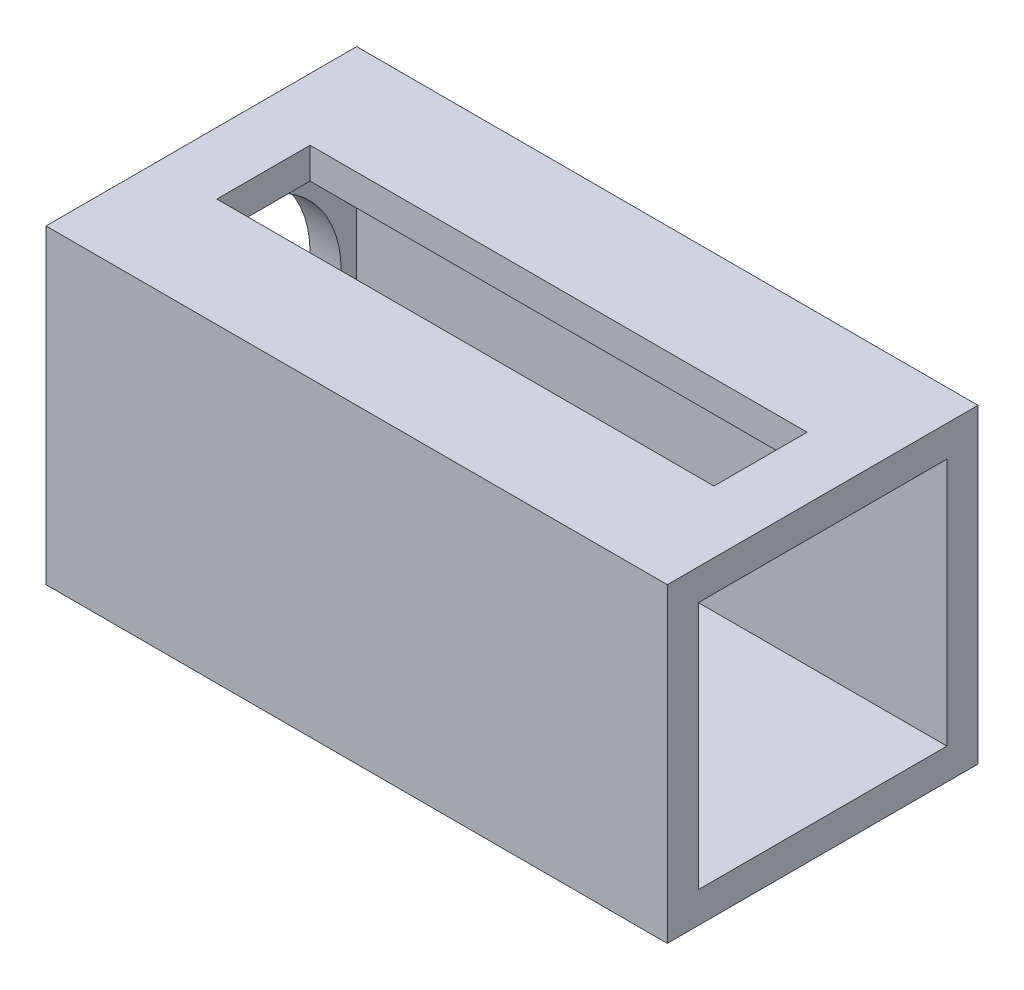
ISO-10303-21;
HEADER;
FILE_DESCRIPTION(('STEP AP214'),'2;1');
FILE_NAME('part.step','',(''),(''),'','','');
FILE_SCHEMA(('AUTOMOTIVE_DESIGN { 1 0 10303 214 1 1 1 1 }'));
ENDSEC;
DATA;
#1=APPLICATION_CONTEXT('core data for automotive mechanical design processes');
#2=APPLICATION_PROTOCOL_DEFINITION('international standard','automotive_design',2000,#1);
#3=PRODUCT_CONTEXT('',#1,'mechanical');
#4=PRODUCT('Part','Part','',(#3));
#5=PRODUCT_RELATED_PRODUCT_CATEGORY('part','',(#4));
#6=PRODUCT_DEFINITION_FORMATION('','',#4);
#7=PRODUCT_DEFINITION_CONTEXT('part definition',#1,'design');
#8=PRODUCT_DEFINITION('design','',#6,#7);
#9=PRODUCT_DEFINITION_SHAPE('','',#8);
#10=(LENGTH_UNIT() NAMED_UNIT(*) SI_UNIT(.MILLI.,.METRE.));
#11=(NAMED_UNIT(*) PLANE_ANGLE_UNIT() SI_UNIT($,.RADIAN.));
#12=(NAMED_UNIT(*) SI_UNIT($,.STERADIAN.) SOLID_ANGLE_UNIT());
#13=UNCERTAINTY_MEASURE_WITH_UNIT(LENGTH_MEASURE(1.E-05),#10,'distance_accuracy_value','');
#14=(GEOMETRIC_REPRESENTATION_CONTEXT(3) GLOBAL_UNCERTAINTY_ASSIGNED_CONTEXT((#13)) GLOBAL_UNIT_ASSIGNED_CONTEXT((#10,
#11,#12)) REPRESENTATION_CONTEXT('',''));
#15=CARTESIAN_POINT('',(0.,0.,0.));
#16=DIRECTION('',(0.,0.,1.));
#17=DIRECTION('',(1.,0.,0.));
#18=AXIS2_PLACEMENT_3D('',#15,#16,#17);
#19=CARTESIAN_POINT('',(10.,-5.,10.));
#20=DIRECTION('',(-1.,0.,0.));
#21=DIRECTION('',(0.,0.,1.));
#22=AXIS2_PLACEMENT_3D('',#19,#20,#21);
#23=PLANE('',#22);
#24=DIRECTION('',(0.,1.,0.));
#25=VECTOR('',#24,1.);
#26=CARTESIAN_POINT('',(10.,-5.,0.));
#27=LINE('',#26,#25);
#28=CARTESIAN_POINT('',(10.,-5.,0.));
#29=VERTEX_POINT('',#28);
#30=CARTESIAN_POINT('',(10.,5.,0.));
#31=VERTEX_POINT('',#30);
#32=EDGE_CURVE('E222',#29,#31,#27,.T.);
#33=ORIENTED_EDGE('',*,*,#32,.T.);
#34=DIRECTION('',(0.,0.,-1.));
#35=VECTOR('',#34,1.);
#36=CARTESIAN_POINT('',(10.,5.,10.));
#37=LINE('',#36,#35);
#38=CARTESIAN_POINT('',(10.,5.,10.));
#39=VERTEX_POINT('',#38);
#40=EDGE_CURVE('E11',#39,#31,#37,.T.);
#41=ORIENTED_EDGE('',*,*,#40,.F.);
#42=DIRECTION('',(0.,1.,0.));
#43=VECTOR('',#42,1.);
#44=CARTESIAN_POINT('',(10.,-5.,10.));
#45=LINE('',#44,#43);
#46=CARTESIAN_POINT('',(10.,-5.,10.));
#47=VERTEX_POINT('',#46);
#48=EDGE_CURVE('E232',#47,#39,#45,.T.);
#49=ORIENTED_EDGE('',*,*,#48,.F.);
#50=DIRECTION('',(0.,0.,-1.));
#51=VECTOR('',#50,1.);
#52=CARTESIAN_POINT('',(10.,-5.,10.));
#53=LINE('',#52,#51);
#54=EDGE_CURVE('E246',#47,#29,#53,.T.);
#55=ORIENTED_EDGE('',*,*,#54,.T.);
#56=EDGE_LOOP('',(#33,#41,#49,#55));
#57=FACE_BOUND('',#56,.T.);
#58=DIRECTION('',(0.,1.,0.));
#59=VECTOR('',#58,1.);
#60=CARTESIAN_POINT('',(10.,0.,1.));
#61=LINE('',#60,#59);
#62=CARTESIAN_POINT('',(10.,-4.,1.));
#63=VERTEX_POINT('',#62);
#64=CARTESIAN_POINT('',(10.,4.,1.));
#65=VERTEX_POINT('',#64);
#66=EDGE_CURVE('E185',#63,#65,#61,.T.);
#67=ORIENTED_EDGE('',*,*,#66,.F.);
#68=DIRECTION('',(0.,0.,-1.));
#69=VECTOR('',#68,1.);
#70=CARTESIAN_POINT('',(10.,-4.,10.));
#71=LINE('',#70,#69);
#72=CARTESIAN_POINT('',(10.,-4.,9.));
#73=VERTEX_POINT('',#72);
#74=EDGE_CURVE('E210',#73,#63,#71,.T.);
#75=ORIENTED_EDGE('',*,*,#74,.F.);
#76=DIRECTION('',(0.,1.,0.));
#77=VECTOR('',#76,1.);
#78=CARTESIAN_POINT('',(10.,0.,9.));
#79=LINE('',#78,#77);
#80=CARTESIAN_POINT('',(10.,4.,9.));
#81=VERTEX_POINT('',#80);
#82=EDGE_CURVE('E203',#73,#81,#79,.T.);
#83=ORIENTED_EDGE('',*,*,#82,.T.);
#84=DIRECTION('',(0.,0.,-1.));
#85=VECTOR('',#84,1.);
#86=CARTESIAN_POINT('',(10.,4.,10.));
#87=LINE('',#86,#85);
#88=EDGE_CURVE('E197',#81,#65,#87,.T.);
#89=ORIENTED_EDGE('',*,*,#88,.T.);
#90=EDGE_LOOP('',(#67,#75,#83,#89));
#91=FACE_BOUND('',#90,.T.);
#92=ADVANCED_FACE('F45',(#57,#91),#23,.F.);
#93=CARTESIAN_POINT('',(-10.,5.,10.));
#94=DIRECTION('',(0.,-1.,0.));
#95=DIRECTION('',(0.,0.,-1.));
#96=AXIS2_PLACEMENT_3D('',#93,#94,#95);
#97=PLANE('',#96);
#98=DIRECTION('',(1.,0.,0.));
#99=VECTOR('',#98,1.);
#100=CARTESIAN_POINT('',(8.,5.,6.5));
#101=LINE('',#100,#99);
#102=CARTESIAN_POINT('',(-8.,5.,6.5));
#103=VERTEX_POINT('',#102);
#104=CARTESIAN_POINT('',(8.,5.,6.5));
#105=VERTEX_POINT('',#104);
#106=EDGE_CURVE('E159',#103,#105,#101,.T.);
#107=ORIENTED_EDGE('',*,*,#106,.F.);
#108=DIRECTION('',(0.,0.,1.));
#109=VECTOR('',#108,1.);
#110=CARTESIAN_POINT('',(-8.,5.,6.5));
#111=LINE('',#110,#109);
#112=CARTESIAN_POINT('',(-8.,5.,3.5));
#113=VERTEX_POINT('',#112);
#114=EDGE_CURVE('E60',#113,#103,#111,.T.);
#115=ORIENTED_EDGE('',*,*,#114,.F.);
#116=DIRECTION('',(-1.,0.,0.));
#117=VECTOR('',#116,1.);
#118=CARTESIAN_POINT('',(8.,5.,3.5));
#119=LINE('',#118,#117);
#120=CARTESIAN_POINT('',(8.,5.,3.5));
#121=VERTEX_POINT('',#120);
#122=EDGE_CURVE('E145',#121,#113,#119,.T.);
#123=ORIENTED_EDGE('',*,*,#122,.F.);
#124=DIRECTION('',(0.,0.,-1.));
#125=VECTOR('',#124,1.);
#126=CARTESIAN_POINT('',(8.,5.,6.5));
#127=LINE('',#126,#125);
#128=EDGE_CURVE('E154',#105,#121,#127,.T.);
#129=ORIENTED_EDGE('',*,*,#128,.F.);
#130=EDGE_LOOP('',(#107,#115,#123,#129));
#131=FACE_BOUND('',#130,.T.);
#132=DIRECTION('',(-1.,0.,0.));
#133=VECTOR('',#132,1.);
#134=CARTESIAN_POINT('',(-10.,5.,0.));
#135=LINE('',#134,#133);
#136=CARTESIAN_POINT('',(-10.,5.,0.));
#137=VERTEX_POINT('',#136);
#138=EDGE_CURVE('E250',#31,#137,#135,.T.);
#139=ORIENTED_EDGE('',*,*,#138,.T.);
#140=DIRECTION('',(0.,0.,-1.));
#141=VECTOR('',#140,1.);
#142=CARTESIAN_POINT('',(-10.,5.,10.));
#143=LINE('',#142,#141);
#144=CARTESIAN_POINT('',(-10.,5.,10.));
#145=VERTEX_POINT('',#144);
#146=EDGE_CURVE('E53',#145,#137,#143,.T.);
#147=ORIENTED_EDGE('',*,*,#146,.F.);
#148=DIRECTION('',(-1.,0.,0.));
#149=VECTOR('',#148,1.);
#150=CARTESIAN_POINT('',(-10.,5.,10.));
#151=LINE('',#150,#149);
#152=EDGE_CURVE('E236',#39,#145,#151,.T.);
#153=ORIENTED_EDGE('',*,*,#152,.F.);
#154=ORIENTED_EDGE('',*,*,#40,.T.);
#155=EDGE_LOOP('',(#139,#147,#153,#154));
#156=FACE_BOUND('',#155,.T.);
#157=ADVANCED_FACE('F157',(#131,#156),#97,.F.);
#158=CARTESIAN_POINT('',(-10.,-5.,10.));
#159=DIRECTION('',(1.,0.,0.));
#160=DIRECTION('',(0.,0.,-1.));
#161=AXIS2_PLACEMENT_3D('',#158,#159,#160);
#162=PLANE('',#161);
#163=CARTESIAN_POINT('',(-10.,0.,5.));
#164=DIRECTION('',(-1.,0.,0.));
#165=DIRECTION('',(0.,0.,1.));
#166=AXIS2_PLACEMENT_3D('',#163,#164,#165);
#167=CIRCLE('',#166,3.5);
#168=CARTESIAN_POINT('',(-10.,0.,8.5));
#169=VERTEX_POINT('',#168);
#170=EDGE_CURVE('E181',#169,#169,#167,.T.);
#171=ORIENTED_EDGE('',*,*,#170,.F.);
#172=EDGE_LOOP('',(#171));
#173=FACE_BOUND('',#172,.T.);
#174=DIRECTION('',(0.,-1.,0.));
#175=VECTOR('',#174,1.);
#176=CARTESIAN_POINT('',(-10.,-5.,0.));
#177=LINE('',#176,#175);
#178=CARTESIAN_POINT('',(-10.,-5.,0.));
#179=VERTEX_POINT('',#178);
#180=EDGE_CURVE('E253',#137,#179,#177,.T.);
#181=ORIENTED_EDGE('',*,*,#180,.T.);
#182=DIRECTION('',(0.,0.,-1.));
#183=VECTOR('',#182,1.);
#184=CARTESIAN_POINT('',(-10.,-5.,10.));
#185=LINE('',#184,#183);
#186=CARTESIAN_POINT('',(-10.,-5.,10.));
#187=VERTEX_POINT('',#186);
#188=EDGE_CURVE('E261',#187,#179,#185,.T.);
#189=ORIENTED_EDGE('',*,*,#188,.F.);
#190=DIRECTION('',(0.,-1.,0.));
#191=VECTOR('',#190,1.);
#192=CARTESIAN_POINT('',(-10.,-5.,10.));
#193=LINE('',#192,#191);
#194=EDGE_CURVE('E240',#145,#187,#193,.T.);
#195=ORIENTED_EDGE('',*,*,#194,.F.);
#196=ORIENTED_EDGE('',*,*,#146,.T.);
#197=EDGE_LOOP('',(#181,#189,#195,#196));
#198=FACE_BOUND('',#197,.T.);
#199=ADVANCED_FACE('F270',(#173,#198),#162,.F.);
#200=CARTESIAN_POINT('',(-10.,-5.,10.));
#201=DIRECTION('',(0.,1.,0.));
#202=DIRECTION('',(0.,0.,1.));
#203=AXIS2_PLACEMENT_3D('',#200,#201,#202);
#204=PLANE('',#203);
#205=DIRECTION('',(1.,0.,0.));
#206=VECTOR('',#205,1.);
#207=CARTESIAN_POINT('',(-10.,-5.,0.));
#208=LINE('',#207,#206);
#209=EDGE_CURVE('E237',#179,#29,#208,.T.);
#210=ORIENTED_EDGE('',*,*,#209,.T.);
#211=ORIENTED_EDGE('',*,*,#54,.F.);
#212=DIRECTION('',(1.,0.,0.));
#213=VECTOR('',#212,1.);
#214=CARTESIAN_POINT('',(-10.,-5.,10.));
#215=LINE('',#214,#213);
#216=EDGE_CURVE('E243',#187,#47,#215,.T.);
#217=ORIENTED_EDGE('',*,*,#216,.F.);
#218=ORIENTED_EDGE('',*,*,#188,.T.);
#219=EDGE_LOOP('',(#210,#211,#217,#218));
#220=FACE_BOUND('',#219,.T.);
#221=ADVANCED_FACE('F278',(#220),#204,.F.);
#222=CARTESIAN_POINT('',(0.,0.,10.));
#223=DIRECTION('',(0.,0.,-1.));
#224=DIRECTION('',(-1.,0.,0.));
#225=AXIS2_PLACEMENT_3D('',#222,#223,#224);
#226=PLANE('',#225);
#227=ORIENTED_EDGE('',*,*,#48,.T.);
#228=ORIENTED_EDGE('',*,*,#152,.T.);
#229=ORIENTED_EDGE('',*,*,#194,.T.);
#230=ORIENTED_EDGE('',*,*,#216,.T.);
#231=EDGE_LOOP('',(#227,#228,#229,#230));
#232=FACE_BOUND('',#231,.T.);
#233=ADVANCED_FACE('F285',(#232),#226,.F.);
#234=CARTESIAN_POINT('',(0.,0.,0.));
#235=DIRECTION('',(0.,0.,-1.));
#236=DIRECTION('',(-1.,0.,0.));
#237=AXIS2_PLACEMENT_3D('',#234,#235,#236);
#238=PLANE('',#237);
#239=ORIENTED_EDGE('',*,*,#32,.F.);
#240=ORIENTED_EDGE('',*,*,#209,.F.);
#241=ORIENTED_EDGE('',*,*,#180,.F.);
#242=ORIENTED_EDGE('',*,*,#138,.F.);
#243=EDGE_LOOP('',(#239,#240,#241,#242));
#244=FACE_BOUND('',#243,.T.);
#245=ADVANCED_FACE('F275',(#244),#238,.T.);
#246=CARTESIAN_POINT('',(-10.,4.,10.));
#247=DIRECTION('',(0.,-1.,0.));
#248=DIRECTION('',(0.,0.,-1.));
#249=AXIS2_PLACEMENT_3D('',#246,#247,#248);
#250=PLANE('',#249);
#251=DIRECTION('',(0.,0.,1.));
#252=VECTOR('',#251,1.);
#253=CARTESIAN_POINT('',(-8.,4.,6.5));
#254=LINE('',#253,#252);
#255=CARTESIAN_POINT('',(-8.,4.,3.5));
#256=VERTEX_POINT('',#255);
#257=CARTESIAN_POINT('',(-8.,4.,6.5));
#258=VERTEX_POINT('',#257);
#259=EDGE_CURVE('E137',#256,#258,#254,.T.);
#260=ORIENTED_EDGE('',*,*,#259,.T.);
#261=DIRECTION('',(1.,0.,0.));
#262=VECTOR('',#261,1.);
#263=CARTESIAN_POINT('',(8.,4.,6.5));
#264=LINE('',#263,#262);
#265=CARTESIAN_POINT('',(7.99999999999999,4.,6.5));
#266=VERTEX_POINT('',#265);
#267=EDGE_CURVE('E165',#258,#266,#264,.T.);
#268=ORIENTED_EDGE('',*,*,#267,.T.);
#269=DIRECTION('',(0.,0.,-1.));
#270=VECTOR('',#269,1.);
#271=CARTESIAN_POINT('',(8.,4.,6.5));
#272=LINE('',#271,#270);
#273=CARTESIAN_POINT('',(8.,4.,3.5));
#274=VERTEX_POINT('',#273);
#275=EDGE_CURVE('E141',#266,#274,#272,.T.);
#276=ORIENTED_EDGE('',*,*,#275,.T.);
#277=DIRECTION('',(-1.,0.,0.));
#278=VECTOR('',#277,1.);
#279=CARTESIAN_POINT('',(8.,4.,3.5));
#280=LINE('',#279,#278);
#281=EDGE_CURVE('E142',#274,#256,#280,.T.);
#282=ORIENTED_EDGE('',*,*,#281,.T.);
#283=EDGE_LOOP('',(#260,#268,#276,#282));
#284=FACE_BOUND('',#283,.T.);
#285=DIRECTION('',(-1.,0.,0.));
#286=VECTOR('',#285,1.);
#287=CARTESIAN_POINT('',(0.,4.,1.));
#288=LINE('',#287,#286);
#289=CARTESIAN_POINT('',(-9.00000000000001,4.,1.));
#290=VERTEX_POINT('',#289);
#291=EDGE_CURVE('E189',#65,#290,#288,.T.);
#292=ORIENTED_EDGE('',*,*,#291,.F.);
#293=ORIENTED_EDGE('',*,*,#88,.F.);
#294=DIRECTION('',(-1.,0.,0.));
#295=VECTOR('',#294,1.);
#296=CARTESIAN_POINT('',(0.,4.,9.));
#297=LINE('',#296,#295);
#298=CARTESIAN_POINT('',(-9.00000000000001,4.,9.));
#299=VERTEX_POINT('',#298);
#300=EDGE_CURVE('E199',#81,#299,#297,.T.);
#301=ORIENTED_EDGE('',*,*,#300,.T.);
#302=DIRECTION('',(0.,0.,-1.));
#303=VECTOR('',#302,1.);
#304=CARTESIAN_POINT('',(-9.00000000000001,4.,10.));
#305=LINE('',#304,#303);
#306=EDGE_CURVE('E193',#299,#290,#305,.T.);
#307=ORIENTED_EDGE('',*,*,#306,.T.);
#308=EDGE_LOOP('',(#292,#293,#301,#307));
#309=FACE_BOUND('',#308,.T.);
#310=ADVANCED_FACE('F300',(#284,#309),#250,.T.);
#311=CARTESIAN_POINT('',(-9.00000000000001,-5.,10.));
#312=DIRECTION('',(1.,0.,0.));
#313=DIRECTION('',(0.,0.,-1.));
#314=AXIS2_PLACEMENT_3D('',#311,#312,#313);
#315=PLANE('',#314);
#316=CARTESIAN_POINT('',(-9.00000000000001,0.,5.));
#317=DIRECTION('',(1.,0.,0.));
#318=DIRECTION('',(0.,0.,-1.));
#319=AXIS2_PLACEMENT_3D('',#316,#317,#318);
#320=CIRCLE('',#319,3.5);
#321=CARTESIAN_POINT('',(-9.00000000000001,0.,1.5));
#322=VERTEX_POINT('',#321);
#323=EDGE_CURVE('E153',#322,#322,#320,.F.);
#324=ORIENTED_EDGE('',*,*,#323,.T.);
#325=EDGE_LOOP('',(#324));
#326=FACE_BOUND('',#325,.T.);
#327=DIRECTION('',(0.,-1.,0.));
#328=VECTOR('',#327,1.);
#329=CARTESIAN_POINT('',(-9.00000000000001,0.,1.));
#330=LINE('',#329,#328);
#331=CARTESIAN_POINT('',(-9.00000000000001,-4.,1.));
#332=VERTEX_POINT('',#331);
#333=EDGE_CURVE('E192',#290,#332,#330,.T.);
#334=ORIENTED_EDGE('',*,*,#333,.F.);
#335=ORIENTED_EDGE('',*,*,#306,.F.);
#336=DIRECTION('',(0.,-1.,0.));
#337=VECTOR('',#336,1.);
#338=CARTESIAN_POINT('',(-9.00000000000001,0.,9.));
#339=LINE('',#338,#337);
#340=CARTESIAN_POINT('',(-9.00000000000001,-4.,9.));
#341=VERTEX_POINT('',#340);
#342=EDGE_CURVE('E202',#299,#341,#339,.T.);
#343=ORIENTED_EDGE('',*,*,#342,.T.);
#344=DIRECTION('',(0.,0.,-1.));
#345=VECTOR('',#344,1.);
#346=CARTESIAN_POINT('',(-9.00000000000001,-4.,10.));
#347=LINE('',#346,#345);
#348=EDGE_CURVE('E198',#341,#332,#347,.T.);
#349=ORIENTED_EDGE('',*,*,#348,.T.);
#350=EDGE_LOOP('',(#334,#335,#343,#349));
#351=FACE_BOUND('',#350,.T.);
#352=ADVANCED_FACE('F315',(#326,#351),#315,.T.);
#353=CARTESIAN_POINT('',(-10.,-4.,10.));
#354=DIRECTION('',(0.,1.,0.));
#355=DIRECTION('',(0.,0.,1.));
#356=AXIS2_PLACEMENT_3D('',#353,#354,#355);
#357=PLANE('',#356);
#358=DIRECTION('',(1.,0.,0.));
#359=VECTOR('',#358,1.);
#360=CARTESIAN_POINT('',(0.,-4.,1.));
#361=LINE('',#360,#359);
#362=EDGE_CURVE('E206',#332,#63,#361,.T.);
#363=ORIENTED_EDGE('',*,*,#362,.F.);
#364=ORIENTED_EDGE('',*,*,#348,.F.);
#365=DIRECTION('',(1.,0.,0.));
#366=VECTOR('',#365,1.);
#367=CARTESIAN_POINT('',(0.,-4.,9.));
#368=LINE('',#367,#366);
#369=EDGE_CURVE('E213',#341,#73,#368,.T.);
#370=ORIENTED_EDGE('',*,*,#369,.T.);
#371=ORIENTED_EDGE('',*,*,#74,.T.);
#372=EDGE_LOOP('',(#363,#364,#370,#371));
#373=FACE_BOUND('',#372,.T.);
#374=ADVANCED_FACE('F311',(#373),#357,.T.);
#375=CARTESIAN_POINT('',(0.,0.,9.));
#376=DIRECTION('',(0.,0.,-1.));
#377=DIRECTION('',(-1.,0.,0.));
#378=AXIS2_PLACEMENT_3D('',#375,#376,#377);
#379=PLANE('',#378);
#380=ORIENTED_EDGE('',*,*,#82,.F.);
#381=ORIENTED_EDGE('',*,*,#369,.F.);
#382=ORIENTED_EDGE('',*,*,#342,.F.);
#383=ORIENTED_EDGE('',*,*,#300,.F.);
#384=EDGE_LOOP('',(#380,#381,#382,#383));
#385=FACE_BOUND('',#384,.T.);
#386=ADVANCED_FACE('F307',(#385),#379,.T.);
#387=CARTESIAN_POINT('',(0.,0.,1.));
#388=DIRECTION('',(0.,0.,-1.));
#389=DIRECTION('',(-1.,0.,0.));
#390=AXIS2_PLACEMENT_3D('',#387,#388,#389);
#391=PLANE('',#390);
#392=ORIENTED_EDGE('',*,*,#66,.T.);
#393=ORIENTED_EDGE('',*,*,#291,.T.);
#394=ORIENTED_EDGE('',*,*,#333,.T.);
#395=ORIENTED_EDGE('',*,*,#362,.T.);
#396=EDGE_LOOP('',(#392,#393,#394,#395));
#397=FACE_BOUND('',#396,.T.);
#398=ADVANCED_FACE('F303',(#397),#391,.F.);
#399=CARTESIAN_POINT('',(10.001,0.,5.));
#400=DIRECTION('',(-1.,0.,0.));
#401=DIRECTION('',(0.,0.,1.));
#402=AXIS2_PLACEMENT_3D('',#399,#400,#401);
#403=CYLINDRICAL_SURFACE('',#402,3.5);
#404=ORIENTED_EDGE('',*,*,#323,.F.);
#405=EDGE_LOOP('',(#404));
#406=FACE_BOUND('',#405,.T.);
#407=ORIENTED_EDGE('',*,*,#170,.T.);
#408=EDGE_LOOP('',(#407));
#409=FACE_BOUND('',#408,.T.);
#410=ADVANCED_FACE('F306',(#406,#409),#403,.F.);
#411=CARTESIAN_POINT('',(-8.,-5.001,6.5));
#412=DIRECTION('',(-1.,0.,0.));
#413=DIRECTION('',(0.,0.,1.));
#414=AXIS2_PLACEMENT_3D('',#411,#412,#413);
#415=PLANE('',#414);
#416=DIRECTION('',(0.,1.,0.));
#417=VECTOR('',#416,1.);
#418=CARTESIAN_POINT('',(-8.,-5.001,3.5));
#419=LINE('',#418,#417);
#420=EDGE_CURVE('E133',#256,#113,#419,.T.);
#421=ORIENTED_EDGE('',*,*,#420,.T.);
#422=ORIENTED_EDGE('',*,*,#114,.T.);
#423=DIRECTION('',(0.,1.,0.));
#424=VECTOR('',#423,1.);
#425=CARTESIAN_POINT('',(-8.,-5.001,6.5));
#426=LINE('',#425,#424);
#427=EDGE_CURVE('E171',#258,#103,#426,.T.);
#428=ORIENTED_EDGE('',*,*,#427,.F.);
#429=ORIENTED_EDGE('',*,*,#259,.F.);
#430=EDGE_LOOP('',(#421,#422,#428,#429));
#431=FACE_BOUND('',#430,.T.);
#432=ADVANCED_FACE('F135',(#431),#415,.F.);
#433=CARTESIAN_POINT('',(8.,-5.001,3.5));
#434=DIRECTION('',(0.,0.,-1.));
#435=DIRECTION('',(-1.,0.,0.));
#436=AXIS2_PLACEMENT_3D('',#433,#434,#435);
#437=PLANE('',#436);
#438=DIRECTION('',(0.,1.,0.));
#439=VECTOR('',#438,1.);
#440=CARTESIAN_POINT('',(8.,-5.001,3.5));
#441=LINE('',#440,#439);
#442=EDGE_CURVE('E148',#274,#121,#441,.T.);
#443=ORIENTED_EDGE('',*,*,#442,.T.);
#444=ORIENTED_EDGE('',*,*,#122,.T.);
#445=ORIENTED_EDGE('',*,*,#420,.F.);
#446=ORIENTED_EDGE('',*,*,#281,.F.);
#447=EDGE_LOOP('',(#443,#444,#445,#446));
#448=FACE_BOUND('',#447,.T.);
#449=ADVANCED_FACE('F146',(#448),#437,.F.);
#450=CARTESIAN_POINT('',(8.,-5.001,6.5));
#451=DIRECTION('',(1.,0.,0.));
#452=DIRECTION('',(0.,0.,-1.));
#453=AXIS2_PLACEMENT_3D('',#450,#451,#452);
#454=PLANE('',#453);
#455=DIRECTION('',(0.,1.,0.));
#456=VECTOR('',#455,1.);
#457=CARTESIAN_POINT('',(8.,-5.001,6.5));
#458=LINE('',#457,#456);
#459=EDGE_CURVE('E68',#266,#105,#458,.T.);
#460=ORIENTED_EDGE('',*,*,#459,.T.);
#461=ORIENTED_EDGE('',*,*,#128,.T.);
#462=ORIENTED_EDGE('',*,*,#442,.F.);
#463=ORIENTED_EDGE('',*,*,#275,.F.);
#464=EDGE_LOOP('',(#460,#461,#462,#463));
#465=FACE_BOUND('',#464,.T.);
#466=ADVANCED_FACE('F328',(#465),#454,.F.);
#467=CARTESIAN_POINT('',(8.,-5.001,6.5));
#468=DIRECTION('',(0.,0.,1.));
#469=DIRECTION('',(1.,0.,0.));
#470=AXIS2_PLACEMENT_3D('',#467,#468,#469);
#471=PLANE('',#470);
#472=ORIENTED_EDGE('',*,*,#427,.T.);
#473=ORIENTED_EDGE('',*,*,#106,.T.);
#474=ORIENTED_EDGE('',*,*,#459,.F.);
#475=ORIENTED_EDGE('',*,*,#267,.F.);
#476=EDGE_LOOP('',(#472,#473,#474,#475));
#477=FACE_BOUND('',#476,.T.);
#478=ADVANCED_FACE('F331',(#477),#471,.F.);
#479=CLOSED_SHELL('',(#92,#157,#199,#221,#233,#245,#310,#352,#374,#386,#398,#410,#432,#449,#466,#478));
#480=MANIFOLD_SOLID_BREP('B2',#479);
#481=ADVANCED_BREP_SHAPE_REPRESENTATION('',(#18,#480),#14);
#482=SHAPE_DEFINITION_REPRESENTATION(#9,#481);
ENDSEC;
END-ISO-10303-21;
